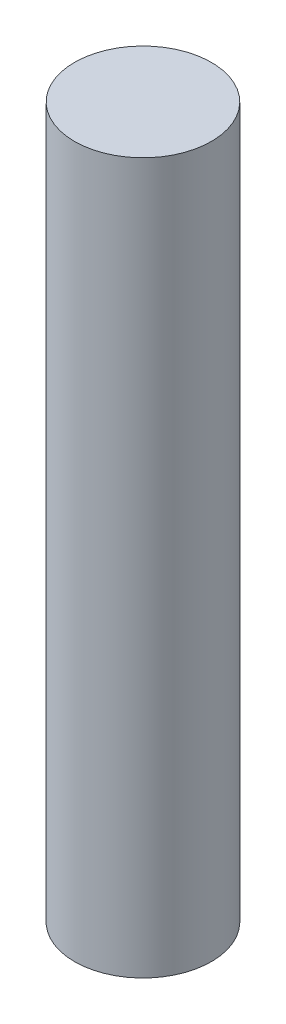
ISO-10303-21;
HEADER;
FILE_DESCRIPTION(('STEP AP214'),'2;1');
FILE_NAME('part.step','',(''),(''),'','','');
FILE_SCHEMA(('AUTOMOTIVE_DESIGN { 1 0 10303 214 1 1 1 1 }'));
ENDSEC;
DATA;
#1=APPLICATION_CONTEXT('core data for automotive mechanical design processes');
#2=APPLICATION_PROTOCOL_DEFINITION('international standard','automotive_design',2000,#1);
#3=PRODUCT_CONTEXT('',#1,'mechanical');
#4=PRODUCT('Part','Part','',(#3));
#5=PRODUCT_RELATED_PRODUCT_CATEGORY('part','',(#4));
#6=PRODUCT_DEFINITION_FORMATION('','',#4);
#7=PRODUCT_DEFINITION_CONTEXT('part definition',#1,'design');
#8=PRODUCT_DEFINITION('design','',#6,#7);
#9=PRODUCT_DEFINITION_SHAPE('','',#8);
#10=(LENGTH_UNIT() NAMED_UNIT(*) SI_UNIT(.MILLI.,.METRE.));
#11=(NAMED_UNIT(*) PLANE_ANGLE_UNIT() SI_UNIT($,.RADIAN.));
#12=(NAMED_UNIT(*) SI_UNIT($,.STERADIAN.) SOLID_ANGLE_UNIT());
#13=UNCERTAINTY_MEASURE_WITH_UNIT(LENGTH_MEASURE(1.E-05),#10,'distance_accuracy_value','');
#14=(GEOMETRIC_REPRESENTATION_CONTEXT(3) GLOBAL_UNCERTAINTY_ASSIGNED_CONTEXT((#13)) GLOBAL_UNIT_ASSIGNED_CONTEXT((#10,
#11,#12)) REPRESENTATION_CONTEXT('',''));
#15=CARTESIAN_POINT('',(0.,0.,0.));
#16=DIRECTION('',(0.,0.,1.));
#17=DIRECTION('',(1.,0.,0.));
#18=AXIS2_PLACEMENT_3D('',#15,#16,#17);
#19=CARTESIAN_POINT('',(0.,-41.5,0.));
#20=DIRECTION('',(0.,1.,0.));
#21=DIRECTION('',(0.,0.,1.));
#22=AXIS2_PLACEMENT_3D('',#19,#20,#21);
#23=CYLINDRICAL_SURFACE('',#22,4.);
#24=CARTESIAN_POINT('',(0.,-41.5,0.));
#25=DIRECTION('',(0.,1.,0.));
#26=DIRECTION('',(0.,0.,1.));
#27=AXIS2_PLACEMENT_3D('',#24,#25,#26);
#28=CIRCLE('',#27,4.);
#29=CARTESIAN_POINT('',(0.,-41.5,4.));
#30=VERTEX_POINT('',#29);
#31=EDGE_CURVE('E10',#30,#30,#28,.T.);
#32=ORIENTED_EDGE('',*,*,#31,.T.);
#33=EDGE_LOOP('',(#32));
#34=FACE_BOUND('',#33,.T.);
#35=CARTESIAN_POINT('',(0.,0.,0.));
#36=DIRECTION('',(0.,1.,0.));
#37=DIRECTION('',(0.,0.,1.));
#38=AXIS2_PLACEMENT_3D('',#35,#36,#37);
#39=CIRCLE('',#38,4.);
#40=CARTESIAN_POINT('',(0.,0.,4.));
#41=VERTEX_POINT('',#40);
#42=EDGE_CURVE('E32',#41,#41,#39,.T.);
#43=ORIENTED_EDGE('',*,*,#42,.F.);
#44=EDGE_LOOP('',(#43));
#45=FACE_BOUND('',#44,.T.);
#46=ADVANCED_FACE('F29',(#34,#45),#23,.T.);
#47=CARTESIAN_POINT('',(0.,-41.5,0.));
#48=DIRECTION('',(0.,1.,0.));
#49=DIRECTION('',(0.,0.,1.));
#50=AXIS2_PLACEMENT_3D('',#47,#48,#49);
#51=PLANE('',#50);
#52=ORIENTED_EDGE('',*,*,#31,.F.);
#53=EDGE_LOOP('',(#52));
#54=FACE_BOUND('',#53,.T.);
#55=ADVANCED_FACE('F44',(#54),#51,.F.);
#56=CARTESIAN_POINT('',(0.,0.,0.));
#57=DIRECTION('',(0.,1.,0.));
#58=DIRECTION('',(0.,0.,1.));
#59=AXIS2_PLACEMENT_3D('',#56,#57,#58);
#60=PLANE('',#59);
#61=ORIENTED_EDGE('',*,*,#42,.T.);
#62=EDGE_LOOP('',(#61));
#63=FACE_BOUND('',#62,.T.);
#64=ADVANCED_FACE('F41',(#63),#60,.T.);
#65=CLOSED_SHELL('',(#46,#55,#64));
#66=MANIFOLD_SOLID_BREP('B2',#65);
#67=ADVANCED_BREP_SHAPE_REPRESENTATION('',(#18,#66),#14);
#68=SHAPE_DEFINITION_REPRESENTATION(#9,#67);
ENDSEC;
END-ISO-10303-21;
